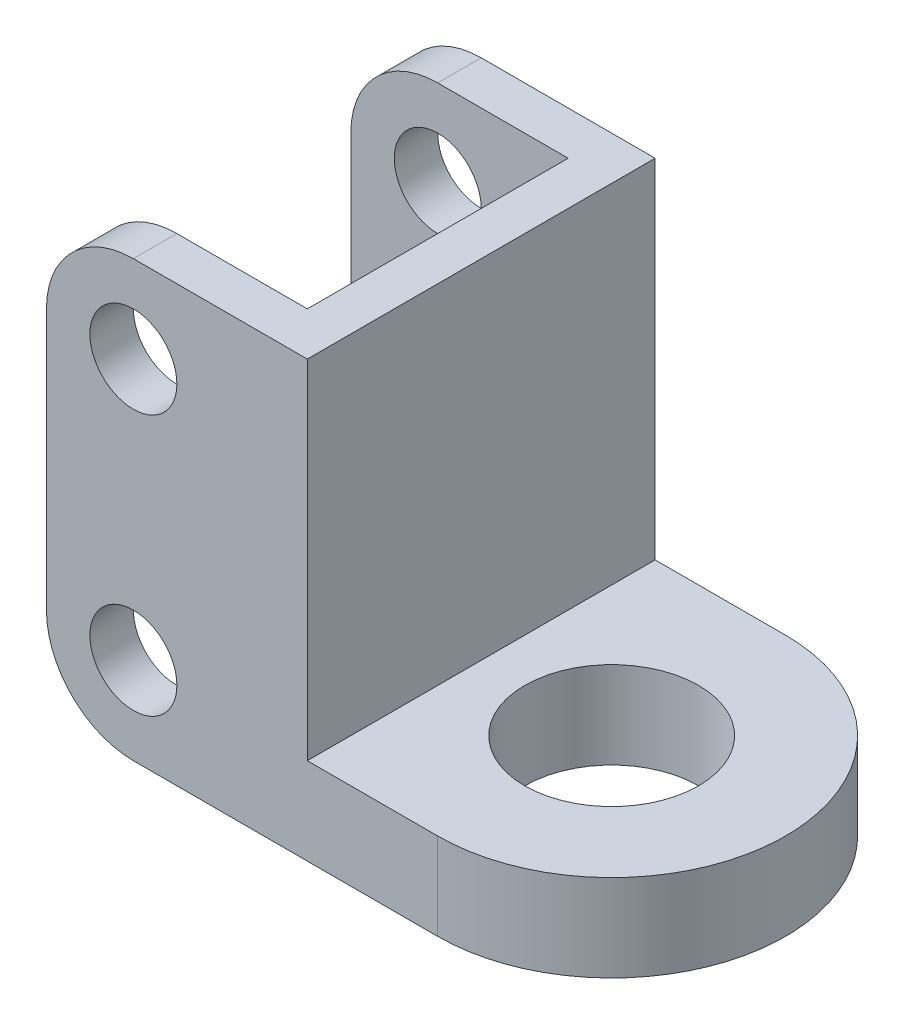
ISO-10303-21;
HEADER;
FILE_DESCRIPTION(('STEP AP214'),'2;1');
FILE_NAME('part.step','',(''),(''),'','','');
FILE_SCHEMA(('AUTOMOTIVE_DESIGN { 1 0 10303 214 1 1 1 1 }'));
ENDSEC;
DATA;
#1=APPLICATION_CONTEXT('core data for automotive mechanical design processes');
#2=APPLICATION_PROTOCOL_DEFINITION('international standard','automotive_design',2000,#1);
#3=PRODUCT_CONTEXT('',#1,'mechanical');
#4=PRODUCT('Part','Part','',(#3));
#5=PRODUCT_RELATED_PRODUCT_CATEGORY('part','',(#4));
#6=PRODUCT_DEFINITION_FORMATION('','',#4);
#7=PRODUCT_DEFINITION_CONTEXT('part definition',#1,'design');
#8=PRODUCT_DEFINITION('design','',#6,#7);
#9=PRODUCT_DEFINITION_SHAPE('','',#8);
#10=(LENGTH_UNIT() NAMED_UNIT(*) SI_UNIT(.MILLI.,.METRE.));
#11=(NAMED_UNIT(*) PLANE_ANGLE_UNIT() SI_UNIT($,.RADIAN.));
#12=(NAMED_UNIT(*) SI_UNIT($,.STERADIAN.) SOLID_ANGLE_UNIT());
#13=UNCERTAINTY_MEASURE_WITH_UNIT(LENGTH_MEASURE(1.E-05),#10,'distance_accuracy_value','');
#14=(GEOMETRIC_REPRESENTATION_CONTEXT(3) GLOBAL_UNCERTAINTY_ASSIGNED_CONTEXT((#13)) GLOBAL_UNIT_ASSIGNED_CONTEXT((#10,
#11,#12)) REPRESENTATION_CONTEXT('',''));
#15=CARTESIAN_POINT('',(0.,0.,0.));
#16=DIRECTION('',(0.,0.,1.));
#17=DIRECTION('',(1.,0.,0.));
#18=AXIS2_PLACEMENT_3D('',#15,#16,#17);
#19=CARTESIAN_POINT('',(22.5,10.,0.));
#20=DIRECTION('',(0.,1.,0.));
#21=DIRECTION('',(0.,0.,1.));
#22=AXIS2_PLACEMENT_3D('',#19,#20,#21);
#23=PLANE('',#22);
#24=DIRECTION('',(0.,0.,1.));
#25=VECTOR('',#24,1.);
#26=CARTESIAN_POINT('',(7.50000000000001,10.,-60.3112887414928));
#27=LINE('',#26,#25);
#28=CARTESIAN_POINT('',(7.50000000000001,10.,-20.));
#29=VERTEX_POINT('',#28);
#30=CARTESIAN_POINT('',(7.50000000000001,10.,20.));
#31=VERTEX_POINT('',#30);
#32=EDGE_CURVE('E146',#29,#31,#27,.T.);
#33=ORIENTED_EDGE('',*,*,#32,.T.);
#34=DIRECTION('',(1.,0.,0.));
#35=VECTOR('',#34,1.);
#36=CARTESIAN_POINT('',(-22.5,10.,20.));
#37=LINE('',#36,#35);
#38=CARTESIAN_POINT('',(22.5,10.,20.));
#39=VERTEX_POINT('',#38);
#40=EDGE_CURVE('E159',#31,#39,#37,.T.);
#41=ORIENTED_EDGE('',*,*,#40,.T.);
#42=CARTESIAN_POINT('',(22.5,10.,0.));
#43=DIRECTION('',(0.,1.,0.));
#44=DIRECTION('',(0.,0.,1.));
#45=AXIS2_PLACEMENT_3D('',#42,#43,#44);
#46=CIRCLE('',#45,20.);
#47=CARTESIAN_POINT('',(22.5,10.,-20.));
#48=VERTEX_POINT('',#47);
#49=EDGE_CURVE('E175',#39,#48,#46,.T.);
#50=ORIENTED_EDGE('',*,*,#49,.T.);
#51=DIRECTION('',(-1.,0.,0.));
#52=VECTOR('',#51,1.);
#53=CARTESIAN_POINT('',(-22.5,10.,-20.));
#54=LINE('',#53,#52);
#55=EDGE_CURVE('E161',#48,#29,#54,.T.);
#56=ORIENTED_EDGE('',*,*,#55,.T.);
#57=EDGE_LOOP('',(#33,#41,#50,#56));
#58=FACE_BOUND('',#57,.T.);
#59=CARTESIAN_POINT('',(22.5,10.,0.));
#60=DIRECTION('',(0.,1.,0.));
#61=DIRECTION('',(0.,0.,1.));
#62=AXIS2_PLACEMENT_3D('',#59,#60,#61);
#63=CIRCLE('',#62,10.);
#64=CARTESIAN_POINT('',(22.5,10.,10.));
#65=VERTEX_POINT('',#64);
#66=EDGE_CURVE('E184',#65,#65,#63,.T.);
#67=ORIENTED_EDGE('',*,*,#66,.F.);
#68=EDGE_LOOP('',(#67));
#69=FACE_BOUND('',#68,.T.);
#70=ADVANCED_FACE('F40',(#58,#69),#23,.T.);
#71=CARTESIAN_POINT('',(22.5,0.,0.));
#72=DIRECTION('',(0.,1.,0.));
#73=DIRECTION('',(0.,0.,1.));
#74=AXIS2_PLACEMENT_3D('',#71,#72,#73);
#75=PLANE('',#74);
#76=DIRECTION('',(1.,0.,0.));
#77=VECTOR('',#76,1.);
#78=CARTESIAN_POINT('',(-22.5,0.,-15.));
#79=LINE('',#78,#77);
#80=CARTESIAN_POINT('',(-12.5,0.,-15.));
#81=VERTEX_POINT('',#80);
#82=CARTESIAN_POINT('',(2.5,0.,-15.));
#83=VERTEX_POINT('',#82);
#84=EDGE_CURVE('E187',#81,#83,#79,.T.);
#85=ORIENTED_EDGE('',*,*,#84,.F.);
#86=DIRECTION('',(0.,0.,1.));
#87=VECTOR('',#86,1.);
#88=CARTESIAN_POINT('',(-12.5,0.,0.));
#89=LINE('',#88,#87);
#90=CARTESIAN_POINT('',(-12.5,0.,-20.));
#91=VERTEX_POINT('',#90);
#92=EDGE_CURVE('E56',#81,#91,#89,.F.);
#93=ORIENTED_EDGE('',*,*,#92,.T.);
#94=DIRECTION('',(-1.,0.,0.));
#95=VECTOR('',#94,1.);
#96=CARTESIAN_POINT('',(-22.5,0.,-20.));
#97=LINE('',#96,#95);
#98=CARTESIAN_POINT('',(22.5,0.,-20.));
#99=VERTEX_POINT('',#98);
#100=EDGE_CURVE('E183',#99,#91,#97,.T.);
#101=ORIENTED_EDGE('',*,*,#100,.F.);
#102=CARTESIAN_POINT('',(22.5,0.,0.));
#103=DIRECTION('',(0.,1.,0.));
#104=DIRECTION('',(0.,0.,1.));
#105=AXIS2_PLACEMENT_3D('',#102,#103,#104);
#106=CIRCLE('',#105,20.);
#107=CARTESIAN_POINT('',(22.5,0.,20.));
#108=VERTEX_POINT('',#107);
#109=EDGE_CURVE('E179',#108,#99,#106,.T.);
#110=ORIENTED_EDGE('',*,*,#109,.F.);
#111=DIRECTION('',(1.,0.,0.));
#112=VECTOR('',#111,1.);
#113=CARTESIAN_POINT('',(-22.5,0.,20.));
#114=LINE('',#113,#112);
#115=CARTESIAN_POINT('',(-12.5,0.,20.));
#116=VERTEX_POINT('',#115);
#117=EDGE_CURVE('E197',#116,#108,#114,.T.);
#118=ORIENTED_EDGE('',*,*,#117,.F.);
#119=DIRECTION('',(0.,0.,1.));
#120=VECTOR('',#119,1.);
#121=CARTESIAN_POINT('',(-12.5,0.,0.));
#122=LINE('',#121,#120);
#123=CARTESIAN_POINT('',(-12.5,0.,15.));
#124=VERTEX_POINT('',#123);
#125=EDGE_CURVE('E277',#116,#124,#122,.F.);
#126=ORIENTED_EDGE('',*,*,#125,.T.);
#127=DIRECTION('',(-1.,0.,0.));
#128=VECTOR('',#127,1.);
#129=CARTESIAN_POINT('',(2.50000000000001,0.,15.));
#130=LINE('',#129,#128);
#131=CARTESIAN_POINT('',(2.50000000000001,0.,15.));
#132=VERTEX_POINT('',#131);
#133=EDGE_CURVE('E193',#132,#124,#130,.T.);
#134=ORIENTED_EDGE('',*,*,#133,.F.);
#135=DIRECTION('',(0.,0.,1.));
#136=VECTOR('',#135,1.);
#137=CARTESIAN_POINT('',(2.5,0.,-15.));
#138=LINE('',#137,#136);
#139=EDGE_CURVE('E190',#83,#132,#138,.T.);
#140=ORIENTED_EDGE('',*,*,#139,.F.);
#141=EDGE_LOOP('',(#85,#93,#101,#110,#118,#126,#134,#140));
#142=FACE_BOUND('',#141,.T.);
#143=CARTESIAN_POINT('',(22.5,0.,0.));
#144=DIRECTION('',(0.,1.,0.));
#145=DIRECTION('',(0.,0.,1.));
#146=AXIS2_PLACEMENT_3D('',#143,#144,#145);
#147=CIRCLE('',#146,10.);
#148=CARTESIAN_POINT('',(22.5,0.,10.));
#149=VERTEX_POINT('',#148);
#150=EDGE_CURVE('E321',#149,#149,#147,.T.);
#151=ORIENTED_EDGE('',*,*,#150,.T.);
#152=EDGE_LOOP('',(#151));
#153=FACE_BOUND('',#152,.T.);
#154=ADVANCED_FACE('F312',(#142,#153),#75,.F.);
#155=CARTESIAN_POINT('',(22.5,10.,0.));
#156=DIRECTION('',(0.,-1.,0.));
#157=DIRECTION('',(0.,0.,-1.));
#158=AXIS2_PLACEMENT_3D('',#155,#156,#157);
#159=CYLINDRICAL_SURFACE('',#158,20.);
#160=ORIENTED_EDGE('',*,*,#109,.T.);
#161=DIRECTION('',(0.,-1.,0.));
#162=VECTOR('',#161,1.);
#163=CARTESIAN_POINT('',(22.5,10.,-20.));
#164=LINE('',#163,#162);
#165=EDGE_CURVE('E222',#48,#99,#164,.T.);
#166=ORIENTED_EDGE('',*,*,#165,.F.);
#167=ORIENTED_EDGE('',*,*,#49,.F.);
#168=DIRECTION('',(0.,-1.,0.));
#169=VECTOR('',#168,1.);
#170=CARTESIAN_POINT('',(22.5,10.,20.));
#171=LINE('',#170,#169);
#172=EDGE_CURVE('E166',#39,#108,#171,.T.);
#173=ORIENTED_EDGE('',*,*,#172,.T.);
#174=EDGE_LOOP('',(#160,#166,#167,#173));
#175=FACE_BOUND('',#174,.T.);
#176=ADVANCED_FACE('F317',(#175),#159,.T.);
#177=CARTESIAN_POINT('',(-22.5,10.,-20.));
#178=DIRECTION('',(0.,0.,1.));
#179=DIRECTION('',(1.,0.,0.));
#180=AXIS2_PLACEMENT_3D('',#177,#178,#179);
#181=PLANE('',#180);
#182=CARTESIAN_POINT('',(-12.5,40.,-20.));
#183=DIRECTION('',(0.,0.,1.));
#184=DIRECTION('',(1.,0.,0.));
#185=AXIS2_PLACEMENT_3D('',#182,#183,#184);
#186=CIRCLE('',#185,5.);
#187=CARTESIAN_POINT('',(-7.49999999999999,40.,-20.));
#188=VERTEX_POINT('',#187);
#189=EDGE_CURVE('E232',#188,#188,#186,.T.);
#190=ORIENTED_EDGE('',*,*,#189,.T.);
#191=EDGE_LOOP('',(#190));
#192=FACE_BOUND('',#191,.T.);
#193=CARTESIAN_POINT('',(-12.5,10.,-20.));
#194=DIRECTION('',(0.,0.,1.));
#195=DIRECTION('',(1.,0.,0.));
#196=AXIS2_PLACEMENT_3D('',#193,#194,#195);
#197=CIRCLE('',#196,5.);
#198=CARTESIAN_POINT('',(-7.49999999999999,10.,-20.));
#199=VERTEX_POINT('',#198);
#200=EDGE_CURVE('E356',#199,#199,#197,.T.);
#201=ORIENTED_EDGE('',*,*,#200,.T.);
#202=EDGE_LOOP('',(#201));
#203=FACE_BOUND('',#202,.T.);
#204=ORIENTED_EDGE('',*,*,#100,.T.);
#205=CARTESIAN_POINT('',(-12.5,10.,-20.));
#206=DIRECTION('',(0.,0.,1.));
#207=DIRECTION('',(1.,0.,0.));
#208=AXIS2_PLACEMENT_3D('',#205,#206,#207);
#209=CIRCLE('',#208,10.);
#210=CARTESIAN_POINT('',(-22.5,10.,-20.));
#211=VERTEX_POINT('',#210);
#212=EDGE_CURVE('E11',#91,#211,#209,.F.);
#213=ORIENTED_EDGE('',*,*,#212,.T.);
#214=DIRECTION('',(0.,-1.,0.));
#215=VECTOR('',#214,1.);
#216=CARTESIAN_POINT('',(-22.5,10.,-20.));
#217=LINE('',#216,#215);
#218=CARTESIAN_POINT('',(-22.5,40.,-20.));
#219=VERTEX_POINT('',#218);
#220=EDGE_CURVE('E218',#219,#211,#217,.T.);
#221=ORIENTED_EDGE('',*,*,#220,.F.);
#222=CARTESIAN_POINT('',(-12.5,40.,-20.));
#223=DIRECTION('',(0.,0.,1.));
#224=DIRECTION('',(1.,0.,0.));
#225=AXIS2_PLACEMENT_3D('',#222,#223,#224);
#226=CIRCLE('',#225,10.);
#227=CARTESIAN_POINT('',(-12.5,50.,-20.));
#228=VERTEX_POINT('',#227);
#229=EDGE_CURVE('E49',#219,#228,#226,.F.);
#230=ORIENTED_EDGE('',*,*,#229,.T.);
#231=DIRECTION('',(1.,0.,0.));
#232=VECTOR('',#231,1.);
#233=CARTESIAN_POINT('',(-22.5,50.,-20.));
#234=LINE('',#233,#232);
#235=CARTESIAN_POINT('',(7.50000000000001,50.,-20.));
#236=VERTEX_POINT('',#235);
#237=EDGE_CURVE('E287',#228,#236,#234,.T.);
#238=ORIENTED_EDGE('',*,*,#237,.T.);
#239=DIRECTION('',(0.,-1.,0.));
#240=VECTOR('',#239,1.);
#241=CARTESIAN_POINT('',(7.50000000000001,50.,-20.));
#242=LINE('',#241,#240);
#243=EDGE_CURVE('E333',#236,#29,#242,.T.);
#244=ORIENTED_EDGE('',*,*,#243,.T.);
#245=ORIENTED_EDGE('',*,*,#55,.F.);
#246=ORIENTED_EDGE('',*,*,#165,.T.);
#247=EDGE_LOOP('',(#204,#213,#221,#230,#238,#244,#245,#246));
#248=FACE_BOUND('',#247,.T.);
#249=ADVANCED_FACE('F286',(#192,#203,#248),#181,.F.);
#250=CARTESIAN_POINT('',(-22.5,10.,-20.));
#251=DIRECTION('',(1.,0.,0.));
#252=DIRECTION('',(0.,0.,-1.));
#253=AXIS2_PLACEMENT_3D('',#250,#251,#252);
#254=PLANE('',#253);
#255=ORIENTED_EDGE('',*,*,#220,.T.);
#256=DIRECTION('',(0.,0.,1.));
#257=VECTOR('',#256,1.);
#258=CARTESIAN_POINT('',(-22.5,10.,-20.));
#259=LINE('',#258,#257);
#260=CARTESIAN_POINT('',(-22.5,10.,-15.));
#261=VERTEX_POINT('',#260);
#262=EDGE_CURVE('E268',#211,#261,#259,.T.);
#263=ORIENTED_EDGE('',*,*,#262,.T.);
#264=DIRECTION('',(0.,-1.,0.));
#265=VECTOR('',#264,1.);
#266=CARTESIAN_POINT('',(-22.5,10.,-15.));
#267=LINE('',#266,#265);
#268=CARTESIAN_POINT('',(-22.5,40.,-15.));
#269=VERTEX_POINT('',#268);
#270=EDGE_CURVE('E215',#269,#261,#267,.T.);
#271=ORIENTED_EDGE('',*,*,#270,.F.);
#272=DIRECTION('',(0.,0.,-1.));
#273=VECTOR('',#272,1.);
#274=CARTESIAN_POINT('',(-22.5,40.,-20.));
#275=LINE('',#274,#273);
#276=EDGE_CURVE('E264',#269,#219,#275,.T.);
#277=ORIENTED_EDGE('',*,*,#276,.T.);
#278=EDGE_LOOP('',(#255,#263,#271,#277));
#279=FACE_BOUND('',#278,.T.);
#280=ADVANCED_FACE('F305',(#279),#254,.F.);
#281=CARTESIAN_POINT('',(-22.5,10.,-15.));
#282=DIRECTION('',(0.,0.,-1.));
#283=DIRECTION('',(-1.,0.,0.));
#284=AXIS2_PLACEMENT_3D('',#281,#282,#283);
#285=PLANE('',#284);
#286=CARTESIAN_POINT('',(-12.5,40.,-15.));
#287=DIRECTION('',(0.,0.,-1.));
#288=DIRECTION('',(-1.,0.,0.));
#289=AXIS2_PLACEMENT_3D('',#286,#287,#288);
#290=CIRCLE('',#289,5.);
#291=CARTESIAN_POINT('',(-17.5,40.,-15.));
#292=VERTEX_POINT('',#291);
#293=EDGE_CURVE('E154',#292,#292,#290,.T.);
#294=ORIENTED_EDGE('',*,*,#293,.T.);
#295=EDGE_LOOP('',(#294));
#296=FACE_BOUND('',#295,.T.);
#297=CARTESIAN_POINT('',(-12.5,10.,-15.));
#298=DIRECTION('',(0.,0.,-1.));
#299=DIRECTION('',(-1.,0.,0.));
#300=AXIS2_PLACEMENT_3D('',#297,#298,#299);
#301=CIRCLE('',#300,5.);
#302=CARTESIAN_POINT('',(-17.5,10.,-15.));
#303=VERTEX_POINT('',#302);
#304=EDGE_CURVE('E238',#303,#303,#301,.T.);
#305=ORIENTED_EDGE('',*,*,#304,.T.);
#306=EDGE_LOOP('',(#305));
#307=FACE_BOUND('',#306,.T.);
#308=ORIENTED_EDGE('',*,*,#270,.T.);
#309=CARTESIAN_POINT('',(-12.5,10.,-15.));
#310=DIRECTION('',(0.,0.,-1.));
#311=DIRECTION('',(-1.,0.,0.));
#312=AXIS2_PLACEMENT_3D('',#309,#310,#311);
#313=CIRCLE('',#312,10.);
#314=EDGE_CURVE('E64',#261,#81,#313,.F.);
#315=ORIENTED_EDGE('',*,*,#314,.T.);
#316=ORIENTED_EDGE('',*,*,#84,.T.);
#317=DIRECTION('',(0.,-1.,0.));
#318=VECTOR('',#317,1.);
#319=CARTESIAN_POINT('',(2.5,10.,-15.));
#320=LINE('',#319,#318);
#321=CARTESIAN_POINT('',(2.50000000000001,50.,-15.));
#322=VERTEX_POINT('',#321);
#323=EDGE_CURVE('E211',#322,#83,#320,.T.);
#324=ORIENTED_EDGE('',*,*,#323,.F.);
#325=DIRECTION('',(1.,0.,0.));
#326=VECTOR('',#325,1.);
#327=CARTESIAN_POINT('',(-22.5,50.,-15.));
#328=LINE('',#327,#326);
#329=CARTESIAN_POINT('',(-12.5,50.,-15.));
#330=VERTEX_POINT('',#329);
#331=EDGE_CURVE('E296',#330,#322,#328,.T.);
#332=ORIENTED_EDGE('',*,*,#331,.F.);
#333=CARTESIAN_POINT('',(-12.5,40.,-15.));
#334=DIRECTION('',(0.,0.,-1.));
#335=DIRECTION('',(-1.,0.,0.));
#336=AXIS2_PLACEMENT_3D('',#333,#334,#335);
#337=CIRCLE('',#336,10.);
#338=EDGE_CURVE('E272',#330,#269,#337,.F.);
#339=ORIENTED_EDGE('',*,*,#338,.T.);
#340=EDGE_LOOP('',(#308,#315,#316,#324,#332,#339));
#341=FACE_BOUND('',#340,.T.);
#342=ADVANCED_FACE('F302',(#296,#307,#341),#285,.F.);
#343=CARTESIAN_POINT('',(2.5,10.,-15.));
#344=DIRECTION('',(1.,0.,0.));
#345=DIRECTION('',(0.,0.,-1.));
#346=AXIS2_PLACEMENT_3D('',#343,#344,#345);
#347=PLANE('',#346);
#348=ORIENTED_EDGE('',*,*,#139,.T.);
#349=DIRECTION('',(0.,-1.,0.));
#350=VECTOR('',#349,1.);
#351=CARTESIAN_POINT('',(2.50000000000001,10.,15.));
#352=LINE('',#351,#350);
#353=CARTESIAN_POINT('',(2.50000000000001,50.,15.));
#354=VERTEX_POINT('',#353);
#355=EDGE_CURVE('E207',#354,#132,#352,.T.);
#356=ORIENTED_EDGE('',*,*,#355,.F.);
#357=DIRECTION('',(0.,0.,1.));
#358=VECTOR('',#357,1.);
#359=CARTESIAN_POINT('',(2.50000000000001,50.,-60.3112887414928));
#360=LINE('',#359,#358);
#361=EDGE_CURVE('E338',#322,#354,#360,.T.);
#362=ORIENTED_EDGE('',*,*,#361,.F.);
#363=ORIENTED_EDGE('',*,*,#323,.T.);
#364=EDGE_LOOP('',(#348,#356,#362,#363));
#365=FACE_BOUND('',#364,.T.);
#366=ADVANCED_FACE('F378',(#365),#347,.F.);
#367=CARTESIAN_POINT('',(2.50000000000001,10.,15.));
#368=DIRECTION('',(0.,0.,1.));
#369=DIRECTION('',(1.,0.,0.));
#370=AXIS2_PLACEMENT_3D('',#367,#368,#369);
#371=PLANE('',#370);
#372=CARTESIAN_POINT('',(-12.5,40.,15.));
#373=DIRECTION('',(0.,0.,1.));
#374=DIRECTION('',(1.,0.,0.));
#375=AXIS2_PLACEMENT_3D('',#372,#373,#374);
#376=CIRCLE('',#375,5.);
#377=CARTESIAN_POINT('',(-7.49999999999999,40.,15.));
#378=VERTEX_POINT('',#377);
#379=EDGE_CURVE('E237',#378,#378,#376,.T.);
#380=ORIENTED_EDGE('',*,*,#379,.T.);
#381=EDGE_LOOP('',(#380));
#382=FACE_BOUND('',#381,.T.);
#383=CARTESIAN_POINT('',(-12.5,10.,15.));
#384=DIRECTION('',(0.,0.,1.));
#385=DIRECTION('',(1.,0.,0.));
#386=AXIS2_PLACEMENT_3D('',#383,#384,#385);
#387=CIRCLE('',#386,5.);
#388=CARTESIAN_POINT('',(-7.49999999999999,10.,15.));
#389=VERTEX_POINT('',#388);
#390=EDGE_CURVE('E231',#389,#389,#387,.T.);
#391=ORIENTED_EDGE('',*,*,#390,.T.);
#392=EDGE_LOOP('',(#391));
#393=FACE_BOUND('',#392,.T.);
#394=DIRECTION('',(0.,-1.,0.));
#395=VECTOR('',#394,1.);
#396=CARTESIAN_POINT('',(-22.5,10.,15.));
#397=LINE('',#396,#395);
#398=CARTESIAN_POINT('',(-22.5,40.,15.));
#399=VERTEX_POINT('',#398);
#400=CARTESIAN_POINT('',(-22.5,10.,15.));
#401=VERTEX_POINT('',#400);
#402=EDGE_CURVE('E203',#399,#401,#397,.T.);
#403=ORIENTED_EDGE('',*,*,#402,.F.);
#404=CARTESIAN_POINT('',(-12.5,40.,15.));
#405=DIRECTION('',(0.,0.,1.));
#406=DIRECTION('',(1.,0.,0.));
#407=AXIS2_PLACEMENT_3D('',#404,#405,#406);
#408=CIRCLE('',#407,10.);
#409=CARTESIAN_POINT('',(-12.5,50.,15.));
#410=VERTEX_POINT('',#409);
#411=EDGE_CURVE('E261',#399,#410,#408,.F.);
#412=ORIENTED_EDGE('',*,*,#411,.T.);
#413=DIRECTION('',(-1.,0.,0.));
#414=VECTOR('',#413,1.);
#415=CARTESIAN_POINT('',(-22.5,50.,15.));
#416=LINE('',#415,#414);
#417=EDGE_CURVE('E297',#354,#410,#416,.T.);
#418=ORIENTED_EDGE('',*,*,#417,.F.);
#419=ORIENTED_EDGE('',*,*,#355,.T.);
#420=ORIENTED_EDGE('',*,*,#133,.T.);
#421=CARTESIAN_POINT('',(-12.5,10.,15.));
#422=DIRECTION('',(0.,0.,1.));
#423=DIRECTION('',(1.,0.,0.));
#424=AXIS2_PLACEMENT_3D('',#421,#422,#423);
#425=CIRCLE('',#424,10.);
#426=EDGE_CURVE('E258',#124,#401,#425,.F.);
#427=ORIENTED_EDGE('',*,*,#426,.T.);
#428=EDGE_LOOP('',(#403,#412,#418,#419,#420,#427));
#429=FACE_BOUND('',#428,.T.);
#430=ADVANCED_FACE('F410',(#382,#393,#429),#371,.F.);
#431=CARTESIAN_POINT('',(-22.5,10.,15.));
#432=DIRECTION('',(1.,0.,0.));
#433=DIRECTION('',(0.,0.,-1.));
#434=AXIS2_PLACEMENT_3D('',#431,#432,#433);
#435=PLANE('',#434);
#436=DIRECTION('',(0.,-1.,0.));
#437=VECTOR('',#436,1.);
#438=CARTESIAN_POINT('',(-22.5,10.,20.));
#439=LINE('',#438,#437);
#440=CARTESIAN_POINT('',(-22.5,40.,20.));
#441=VERTEX_POINT('',#440);
#442=CARTESIAN_POINT('',(-22.5,10.,20.));
#443=VERTEX_POINT('',#442);
#444=EDGE_CURVE('E173',#441,#443,#439,.T.);
#445=ORIENTED_EDGE('',*,*,#444,.F.);
#446=DIRECTION('',(0.,0.,1.));
#447=VECTOR('',#446,1.);
#448=CARTESIAN_POINT('',(-22.5,40.,15.));
#449=LINE('',#448,#447);
#450=EDGE_CURVE('E255',#441,#399,#449,.F.);
#451=ORIENTED_EDGE('',*,*,#450,.T.);
#452=ORIENTED_EDGE('',*,*,#402,.T.);
#453=DIRECTION('',(0.,0.,1.));
#454=VECTOR('',#453,1.);
#455=CARTESIAN_POINT('',(-22.5,10.,15.));
#456=LINE('',#455,#454);
#457=EDGE_CURVE('E251',#401,#443,#456,.T.);
#458=ORIENTED_EDGE('',*,*,#457,.T.);
#459=EDGE_LOOP('',(#445,#451,#452,#458));
#460=FACE_BOUND('',#459,.T.);
#461=ADVANCED_FACE('F406',(#460),#435,.F.);
#462=CARTESIAN_POINT('',(-22.5,10.,20.));
#463=DIRECTION('',(0.,0.,-1.));
#464=DIRECTION('',(-1.,0.,0.));
#465=AXIS2_PLACEMENT_3D('',#462,#463,#464);
#466=PLANE('',#465);
#467=CARTESIAN_POINT('',(-12.5,40.,20.));
#468=DIRECTION('',(0.,0.,-1.));
#469=DIRECTION('',(-1.,0.,0.));
#470=AXIS2_PLACEMENT_3D('',#467,#468,#469);
#471=CIRCLE('',#470,5.);
#472=CARTESIAN_POINT('',(-17.5,40.,20.));
#473=VERTEX_POINT('',#472);
#474=EDGE_CURVE('E233',#473,#473,#471,.T.);
#475=ORIENTED_EDGE('',*,*,#474,.T.);
#476=EDGE_LOOP('',(#475));
#477=FACE_BOUND('',#476,.T.);
#478=CARTESIAN_POINT('',(-12.5,10.,20.));
#479=DIRECTION('',(0.,0.,-1.));
#480=DIRECTION('',(-1.,0.,0.));
#481=AXIS2_PLACEMENT_3D('',#478,#479,#480);
#482=CIRCLE('',#481,5.);
#483=CARTESIAN_POINT('',(-17.5,10.,20.));
#484=VERTEX_POINT('',#483);
#485=EDGE_CURVE('E227',#484,#484,#482,.T.);
#486=ORIENTED_EDGE('',*,*,#485,.T.);
#487=EDGE_LOOP('',(#486));
#488=FACE_BOUND('',#487,.T.);
#489=DIRECTION('',(-1.,0.,0.));
#490=VECTOR('',#489,1.);
#491=CARTESIAN_POINT('',(-22.5,50.,20.));
#492=LINE('',#491,#490);
#493=CARTESIAN_POINT('',(7.50000000000001,50.,20.));
#494=VERTEX_POINT('',#493);
#495=CARTESIAN_POINT('',(-12.5,50.,20.));
#496=VERTEX_POINT('',#495);
#497=EDGE_CURVE('E330',#494,#496,#492,.T.);
#498=ORIENTED_EDGE('',*,*,#497,.T.);
#499=CARTESIAN_POINT('',(-12.5,40.,20.));
#500=DIRECTION('',(0.,0.,-1.));
#501=DIRECTION('',(-1.,0.,0.));
#502=AXIS2_PLACEMENT_3D('',#499,#500,#501);
#503=CIRCLE('',#502,10.);
#504=EDGE_CURVE('E248',#496,#441,#503,.F.);
#505=ORIENTED_EDGE('',*,*,#504,.T.);
#506=ORIENTED_EDGE('',*,*,#444,.T.);
#507=CARTESIAN_POINT('',(-12.5,10.,20.));
#508=DIRECTION('',(0.,0.,-1.));
#509=DIRECTION('',(-1.,0.,0.));
#510=AXIS2_PLACEMENT_3D('',#507,#508,#509);
#511=CIRCLE('',#510,10.);
#512=EDGE_CURVE('E245',#443,#116,#511,.F.);
#513=ORIENTED_EDGE('',*,*,#512,.T.);
#514=ORIENTED_EDGE('',*,*,#117,.T.);
#515=ORIENTED_EDGE('',*,*,#172,.F.);
#516=ORIENTED_EDGE('',*,*,#40,.F.);
#517=DIRECTION('',(0.,1.,0.));
#518=VECTOR('',#517,1.);
#519=CARTESIAN_POINT('',(7.50000000000001,50.,20.));
#520=LINE('',#519,#518);
#521=EDGE_CURVE('E142',#31,#494,#520,.T.);
#522=ORIENTED_EDGE('',*,*,#521,.T.);
#523=EDGE_LOOP('',(#498,#505,#506,#513,#514,#515,#516,#522));
#524=FACE_BOUND('',#523,.T.);
#525=ADVANCED_FACE('F164',(#477,#488,#524),#466,.F.);
#526=CARTESIAN_POINT('',(22.5,10.,0.));
#527=DIRECTION('',(0.,-1.,0.));
#528=DIRECTION('',(0.,0.,-1.));
#529=AXIS2_PLACEMENT_3D('',#526,#527,#528);
#530=CYLINDRICAL_SURFACE('',#529,10.);
#531=ORIENTED_EDGE('',*,*,#66,.T.);
#532=EDGE_LOOP('',(#531));
#533=FACE_BOUND('',#532,.T.);
#534=ORIENTED_EDGE('',*,*,#150,.F.);
#535=EDGE_LOOP('',(#534));
#536=FACE_BOUND('',#535,.T.);
#537=ADVANCED_FACE('F401',(#533,#536),#530,.F.);
#538=CARTESIAN_POINT('',(-22.5,50.,-15.));
#539=DIRECTION('',(0.,1.,0.));
#540=DIRECTION('',(0.,0.,1.));
#541=AXIS2_PLACEMENT_3D('',#538,#539,#540);
#542=PLANE('',#541);
#543=ORIENTED_EDGE('',*,*,#417,.T.);
#544=DIRECTION('',(0.,0.,1.));
#545=VECTOR('',#544,1.);
#546=CARTESIAN_POINT('',(-12.5,50.,20.));
#547=LINE('',#546,#545);
#548=EDGE_CURVE('E241',#410,#496,#547,.T.);
#549=ORIENTED_EDGE('',*,*,#548,.T.);
#550=ORIENTED_EDGE('',*,*,#497,.F.);
#551=DIRECTION('',(0.,0.,1.));
#552=VECTOR('',#551,1.);
#553=CARTESIAN_POINT('',(7.50000000000001,50.,-60.3112887414928));
#554=LINE('',#553,#552);
#555=EDGE_CURVE('E149',#236,#494,#554,.T.);
#556=ORIENTED_EDGE('',*,*,#555,.F.);
#557=ORIENTED_EDGE('',*,*,#237,.F.);
#558=DIRECTION('',(0.,0.,-1.));
#559=VECTOR('',#558,1.);
#560=CARTESIAN_POINT('',(-12.5,50.,-15.));
#561=LINE('',#560,#559);
#562=EDGE_CURVE('E226',#228,#330,#561,.F.);
#563=ORIENTED_EDGE('',*,*,#562,.T.);
#564=ORIENTED_EDGE('',*,*,#331,.T.);
#565=ORIENTED_EDGE('',*,*,#361,.T.);
#566=EDGE_LOOP('',(#543,#549,#550,#556,#557,#563,#564,#565));
#567=FACE_BOUND('',#566,.T.);
#568=ADVANCED_FACE('F293',(#567),#542,.T.);
#569=CARTESIAN_POINT('',(7.50000000000001,50.,-60.3112887414928));
#570=DIRECTION('',(1.,0.,0.));
#571=DIRECTION('',(0.,1.,0.));
#572=AXIS2_PLACEMENT_3D('',#569,#570,#571);
#573=PLANE('',#572);
#574=ORIENTED_EDGE('',*,*,#243,.F.);
#575=ORIENTED_EDGE('',*,*,#555,.T.);
#576=ORIENTED_EDGE('',*,*,#521,.F.);
#577=ORIENTED_EDGE('',*,*,#32,.F.);
#578=EDGE_LOOP('',(#574,#575,#576,#577));
#579=FACE_BOUND('',#578,.T.);
#580=ADVANCED_FACE('F145',(#579),#573,.T.);
#581=CARTESIAN_POINT('',(-12.5,10.,-20.));
#582=DIRECTION('',(0.,0.,1.));
#583=DIRECTION('',(1.,0.,0.));
#584=AXIS2_PLACEMENT_3D('',#581,#582,#583);
#585=CYLINDRICAL_SURFACE('',#584,5.);
#586=ORIENTED_EDGE('',*,*,#485,.F.);
#587=EDGE_LOOP('',(#586));
#588=FACE_BOUND('',#587,.T.);
#589=ORIENTED_EDGE('',*,*,#390,.F.);
#590=EDGE_LOOP('',(#589));
#591=FACE_BOUND('',#590,.T.);
#592=ADVANCED_FACE('F385',(#588,#591),#585,.F.);
#593=CARTESIAN_POINT('',(-12.5,40.,-20.));
#594=DIRECTION('',(0.,0.,1.));
#595=DIRECTION('',(1.,0.,0.));
#596=AXIS2_PLACEMENT_3D('',#593,#594,#595);
#597=CYLINDRICAL_SURFACE('',#596,5.);
#598=ORIENTED_EDGE('',*,*,#474,.F.);
#599=EDGE_LOOP('',(#598));
#600=FACE_BOUND('',#599,.T.);
#601=ORIENTED_EDGE('',*,*,#379,.F.);
#602=EDGE_LOOP('',(#601));
#603=FACE_BOUND('',#602,.T.);
#604=ADVANCED_FACE('F373',(#600,#603),#597,.F.);
#605=ORIENTED_EDGE('',*,*,#200,.F.);
#606=EDGE_LOOP('',(#605));
#607=FACE_BOUND('',#606,.T.);
#608=ORIENTED_EDGE('',*,*,#304,.F.);
#609=EDGE_LOOP('',(#608));
#610=FACE_BOUND('',#609,.T.);
#611=ADVANCED_FACE('F371',(#607,#610),#585,.F.);
#612=ORIENTED_EDGE('',*,*,#189,.F.);
#613=EDGE_LOOP('',(#612));
#614=FACE_BOUND('',#613,.T.);
#615=ORIENTED_EDGE('',*,*,#293,.F.);
#616=EDGE_LOOP('',(#615));
#617=FACE_BOUND('',#616,.T.);
#618=ADVANCED_FACE('F367',(#614,#617),#597,.F.);
#619=CARTESIAN_POINT('',(-12.5,40.,-15.));
#620=DIRECTION('',(0.,0.,-1.));
#621=DIRECTION('',(-1.,0.,0.));
#622=AXIS2_PLACEMENT_3D('',#619,#620,#621);
#623=CYLINDRICAL_SURFACE('',#622,10.);
#624=ORIENTED_EDGE('',*,*,#411,.F.);
#625=ORIENTED_EDGE('',*,*,#450,.F.);
#626=ORIENTED_EDGE('',*,*,#504,.F.);
#627=ORIENTED_EDGE('',*,*,#548,.F.);
#628=EDGE_LOOP('',(#624,#625,#626,#627));
#629=FACE_BOUND('',#628,.T.);
#630=ADVANCED_FACE('F370',(#629),#623,.T.);
#631=CARTESIAN_POINT('',(-12.5,10.,-20.));
#632=DIRECTION('',(0.,0.,1.));
#633=DIRECTION('',(1.,0.,0.));
#634=AXIS2_PLACEMENT_3D('',#631,#632,#633);
#635=CYLINDRICAL_SURFACE('',#634,10.);
#636=ORIENTED_EDGE('',*,*,#212,.F.);
#637=ORIENTED_EDGE('',*,*,#92,.F.);
#638=ORIENTED_EDGE('',*,*,#314,.F.);
#639=ORIENTED_EDGE('',*,*,#262,.F.);
#640=EDGE_LOOP('',(#636,#637,#638,#639));
#641=FACE_BOUND('',#640,.T.);
#642=ADVANCED_FACE('F309',(#641),#635,.T.);
#643=CARTESIAN_POINT('',(-12.5,40.,-20.));
#644=DIRECTION('',(0.,0.,1.));
#645=DIRECTION('',(1.,0.,0.));
#646=AXIS2_PLACEMENT_3D('',#643,#644,#645);
#647=CYLINDRICAL_SURFACE('',#646,10.);
#648=ORIENTED_EDGE('',*,*,#338,.F.);
#649=ORIENTED_EDGE('',*,*,#562,.F.);
#650=ORIENTED_EDGE('',*,*,#229,.F.);
#651=ORIENTED_EDGE('',*,*,#276,.F.);
#652=EDGE_LOOP('',(#648,#649,#650,#651));
#653=FACE_BOUND('',#652,.T.);
#654=ADVANCED_FACE('F300',(#653),#647,.T.);
#655=CARTESIAN_POINT('',(-12.5,10.,15.));
#656=DIRECTION('',(0.,0.,1.));
#657=DIRECTION('',(1.,0.,0.));
#658=AXIS2_PLACEMENT_3D('',#655,#656,#657);
#659=CYLINDRICAL_SURFACE('',#658,10.);
#660=ORIENTED_EDGE('',*,*,#426,.F.);
#661=ORIENTED_EDGE('',*,*,#125,.F.);
#662=ORIENTED_EDGE('',*,*,#512,.F.);
#663=ORIENTED_EDGE('',*,*,#457,.F.);
#664=EDGE_LOOP('',(#660,#661,#662,#663));
#665=FACE_BOUND('',#664,.T.);
#666=ADVANCED_FACE('F42',(#665),#659,.T.);
#667=CLOSED_SHELL('',(#70,#154,#176,#249,#280,#342,#366,#430,#461,#525,#537,#568,#580,#592,#604,
#611,#618,#630,#642,#654,#666));
#668=MANIFOLD_SOLID_BREP('B2',#667);
#669=ADVANCED_BREP_SHAPE_REPRESENTATION('',(#18,#668),#14);
#670=SHAPE_DEFINITION_REPRESENTATION(#9,#669);
ENDSEC;
END-ISO-10303-21;
